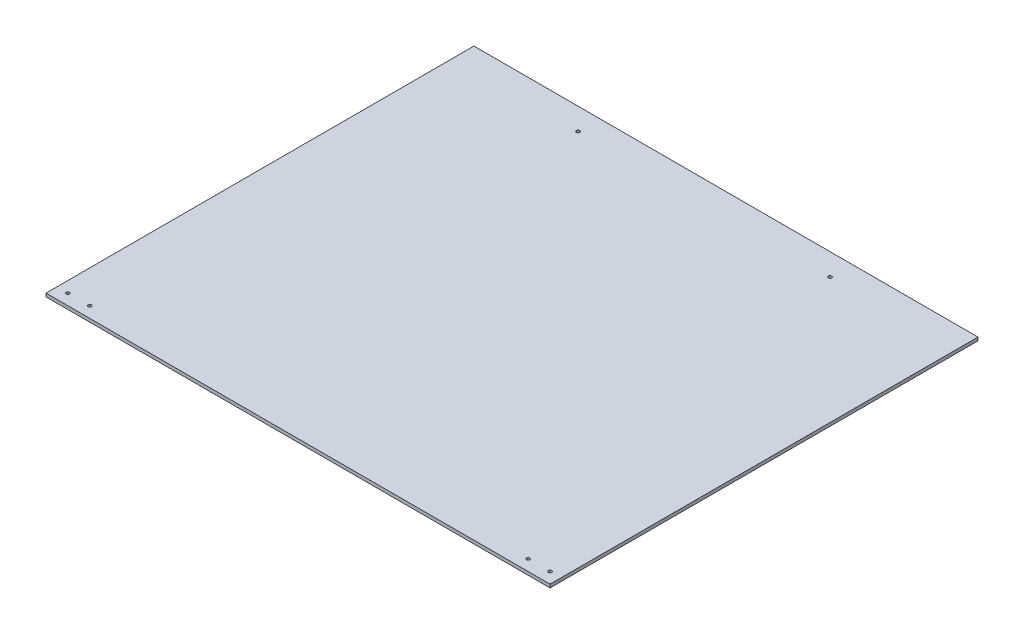
ISO-10303-21;
HEADER;
FILE_DESCRIPTION(('STEP AP214'),'2;1');
FILE_NAME('part.step','',(''),(''),'','','');
FILE_SCHEMA(('AUTOMOTIVE_DESIGN { 1 0 10303 214 1 1 1 1 }'));
ENDSEC;
DATA;
#1=APPLICATION_CONTEXT('core data for automotive mechanical design processes');
#2=APPLICATION_PROTOCOL_DEFINITION('international standard','automotive_design',2000,#1);
#3=PRODUCT_CONTEXT('',#1,'mechanical');
#4=PRODUCT('Part','Part','',(#3));
#5=PRODUCT_RELATED_PRODUCT_CATEGORY('part','',(#4));
#6=PRODUCT_DEFINITION_FORMATION('','',#4);
#7=PRODUCT_DEFINITION_CONTEXT('part definition',#1,'design');
#8=PRODUCT_DEFINITION('design','',#6,#7);
#9=PRODUCT_DEFINITION_SHAPE('','',#8);
#10=(LENGTH_UNIT() NAMED_UNIT(*) SI_UNIT(.MILLI.,.METRE.));
#11=(NAMED_UNIT(*) PLANE_ANGLE_UNIT() SI_UNIT($,.RADIAN.));
#12=(NAMED_UNIT(*) SI_UNIT($,.STERADIAN.) SOLID_ANGLE_UNIT());
#13=UNCERTAINTY_MEASURE_WITH_UNIT(LENGTH_MEASURE(1.E-05),#10,'distance_accuracy_value','');
#14=(GEOMETRIC_REPRESENTATION_CONTEXT(3) GLOBAL_UNCERTAINTY_ASSIGNED_CONTEXT((#13)) GLOBAL_UNIT_ASSIGNED_CONTEXT((#10,
#11,#12)) REPRESENTATION_CONTEXT('',''));
#15=CARTESIAN_POINT('',(0.,0.,0.));
#16=DIRECTION('',(0.,0.,1.));
#17=DIRECTION('',(1.,0.,0.));
#18=AXIS2_PLACEMENT_3D('',#15,#16,#17);
#19=CARTESIAN_POINT('',(0.,3.,0.));
#20=DIRECTION('',(0.,1.,0.));
#21=DIRECTION('',(0.,0.,1.));
#22=AXIS2_PLACEMENT_3D('',#19,#20,#21);
#23=PLANE('',#22);
#24=CARTESIAN_POINT('',(-285.289572375465,3.,238.794136116885));
#25=DIRECTION('',(0.,1.,0.));
#26=DIRECTION('',(0.,0.,-1.));
#27=AXIS2_PLACEMENT_3D('',#24,#25,#26);
#28=CIRCLE('',#27,1.50000000000002);
#29=CARTESIAN_POINT('',(-285.289572375465,3.,237.294136116885));
#30=VERTEX_POINT('',#29);
#31=EDGE_CURVE('E127',#30,#30,#28,.T.);
#32=ORIENTED_EDGE('',*,*,#31,.F.);
#33=EDGE_LOOP('',(#32));
#34=FACE_BOUND('',#33,.T.);
#35=CARTESIAN_POINT('',(-265.289572375465,3.,238.794136116885));
#36=DIRECTION('',(0.,1.,0.));
#37=DIRECTION('',(0.,0.,-1.));
#38=AXIS2_PLACEMENT_3D('',#35,#36,#37);
#39=CIRCLE('',#38,1.50000000000002);
#40=CARTESIAN_POINT('',(-265.289572375465,3.,237.294136116885));
#41=VERTEX_POINT('',#40);
#42=EDGE_CURVE('E261',#41,#41,#39,.T.);
#43=ORIENTED_EDGE('',*,*,#42,.F.);
#44=EDGE_LOOP('',(#43));
#45=FACE_BOUND('',#44,.T.);
#46=CARTESIAN_POINT('',(134.709727779496,3.,238.794136116885));
#47=DIRECTION('',(0.,1.,0.));
#48=DIRECTION('',(0.,0.,1.));
#49=AXIS2_PLACEMENT_3D('',#46,#47,#48);
#50=CIRCLE('',#49,1.5);
#51=CARTESIAN_POINT('',(134.709727779496,3.,240.294136116885));
#52=VERTEX_POINT('',#51);
#53=EDGE_CURVE('E269',#52,#52,#50,.T.);
#54=ORIENTED_EDGE('',*,*,#53,.F.);
#55=EDGE_LOOP('',(#54));
#56=FACE_BOUND('',#55,.T.);
#57=CARTESIAN_POINT('',(154.709727779496,3.,238.794136116885));
#58=DIRECTION('',(0.,1.,0.));
#59=DIRECTION('',(0.,0.,1.));
#60=AXIS2_PLACEMENT_3D('',#57,#58,#59);
#61=CIRCLE('',#60,1.5);
#62=CARTESIAN_POINT('',(154.709727779496,3.,240.294136116885));
#63=VERTEX_POINT('',#62);
#64=EDGE_CURVE('E274',#63,#63,#61,.T.);
#65=ORIENTED_EDGE('',*,*,#64,.F.);
#66=EDGE_LOOP('',(#65));
#67=FACE_BOUND('',#66,.T.);
#68=CARTESIAN_POINT('',(-180.289572375465,3.,-121.737381871304));
#69=DIRECTION('',(0.,1.,0.));
#70=DIRECTION('',(0.,0.,1.));
#71=AXIS2_PLACEMENT_3D('',#68,#69,#70);
#72=CIRCLE('',#71,1.5);
#73=CARTESIAN_POINT('',(-180.289572375465,3.,-120.237381871304));
#74=VERTEX_POINT('',#73);
#75=EDGE_CURVE('E99',#74,#74,#72,.T.);
#76=ORIENTED_EDGE('',*,*,#75,.F.);
#77=EDGE_LOOP('',(#76));
#78=FACE_BOUND('',#77,.T.);
#79=DIRECTION('',(-1.,0.,0.));
#80=VECTOR('',#79,1.);
#81=CARTESIAN_POINT('',(-190.289572375465,3.,-141.737381871304));
#82=LINE('',#81,#80);
#83=CARTESIAN_POINT('',(164.709727779496,3.,-141.737381871304));
#84=VERTEX_POINT('',#83);
#85=CARTESIAN_POINT('',(-295.289572375465,3.,-141.737381871304));
#86=VERTEX_POINT('',#85);
#87=EDGE_CURVE('E50',#84,#86,#82,.T.);
#88=ORIENTED_EDGE('',*,*,#87,.T.);
#89=DIRECTION('',(0.,0.,1.));
#90=VECTOR('',#89,1.);
#91=CARTESIAN_POINT('',(-295.289572375465,3.,-141.737381871304));
#92=LINE('',#91,#90);
#93=CARTESIAN_POINT('',(-295.289572375465,3.,248.794136116885));
#94=VERTEX_POINT('',#93);
#95=EDGE_CURVE('E81',#86,#94,#92,.T.);
#96=ORIENTED_EDGE('',*,*,#95,.T.);
#97=DIRECTION('',(1.,0.,0.));
#98=VECTOR('',#97,1.);
#99=CARTESIAN_POINT('',(-295.289572375465,3.,248.794136116885));
#100=LINE('',#99,#98);
#101=CARTESIAN_POINT('',(164.709727779496,3.,248.794136116885));
#102=VERTEX_POINT('',#101);
#103=EDGE_CURVE('E85',#94,#102,#100,.T.);
#104=ORIENTED_EDGE('',*,*,#103,.T.);
#105=DIRECTION('',(0.,0.,-1.));
#106=VECTOR('',#105,1.);
#107=CARTESIAN_POINT('',(164.709727779496,3.,248.794136116885));
#108=LINE('',#107,#106);
#109=EDGE_CURVE('E92',#102,#84,#108,.T.);
#110=ORIENTED_EDGE('',*,*,#109,.T.);
#111=EDGE_LOOP('',(#88,#96,#104,#110));
#112=FACE_BOUND('',#111,.T.);
#113=CARTESIAN_POINT('',(49.7104276245351,3.,-121.737381871304));
#114=DIRECTION('',(0.,1.,0.));
#115=DIRECTION('',(0.,0.,1.));
#116=AXIS2_PLACEMENT_3D('',#113,#114,#115);
#117=CIRCLE('',#116,1.50000000000002);
#118=CARTESIAN_POINT('',(49.7104276245351,3.,-120.237381871304));
#119=VERTEX_POINT('',#118);
#120=EDGE_CURVE('E121',#119,#119,#117,.T.);
#121=ORIENTED_EDGE('',*,*,#120,.F.);
#122=EDGE_LOOP('',(#121));
#123=FACE_BOUND('',#122,.T.);
#124=ADVANCED_FACE('F33',(#34,#45,#56,#67,#78,#112,#123),#23,.T.);
#125=CARTESIAN_POINT('',(0.,0.,0.));
#126=DIRECTION('',(0.,1.,0.));
#127=DIRECTION('',(0.,0.,1.));
#128=AXIS2_PLACEMENT_3D('',#125,#126,#127);
#129=PLANE('',#128);
#130=CARTESIAN_POINT('',(-285.289572375465,0.,238.794136116885));
#131=DIRECTION('',(0.,1.,0.));
#132=DIRECTION('',(0.,0.,-1.));
#133=AXIS2_PLACEMENT_3D('',#130,#131,#132);
#134=CIRCLE('',#133,1.50000000000002);
#135=CARTESIAN_POINT('',(-285.289572375465,0.,237.294136116885));
#136=VERTEX_POINT('',#135);
#137=EDGE_CURVE('E122',#136,#136,#134,.T.);
#138=ORIENTED_EDGE('',*,*,#137,.T.);
#139=EDGE_LOOP('',(#138));
#140=FACE_BOUND('',#139,.T.);
#141=CARTESIAN_POINT('',(-265.289572375465,0.,238.794136116885));
#142=DIRECTION('',(0.,1.,0.));
#143=DIRECTION('',(0.,0.,-1.));
#144=AXIS2_PLACEMENT_3D('',#141,#142,#143);
#145=CIRCLE('',#144,1.50000000000002);
#146=CARTESIAN_POINT('',(-265.289572375465,0.,237.294136116885));
#147=VERTEX_POINT('',#146);
#148=EDGE_CURVE('E258',#147,#147,#145,.T.);
#149=ORIENTED_EDGE('',*,*,#148,.T.);
#150=EDGE_LOOP('',(#149));
#151=FACE_BOUND('',#150,.T.);
#152=CARTESIAN_POINT('',(134.709727779496,0.,238.794136116885));
#153=DIRECTION('',(0.,1.,0.));
#154=DIRECTION('',(0.,0.,1.));
#155=AXIS2_PLACEMENT_3D('',#152,#153,#154);
#156=CIRCLE('',#155,1.5);
#157=CARTESIAN_POINT('',(134.709727779496,0.,240.294136116885));
#158=VERTEX_POINT('',#157);
#159=EDGE_CURVE('E266',#158,#158,#156,.T.);
#160=ORIENTED_EDGE('',*,*,#159,.T.);
#161=EDGE_LOOP('',(#160));
#162=FACE_BOUND('',#161,.T.);
#163=CARTESIAN_POINT('',(154.709727779496,0.,238.794136116885));
#164=DIRECTION('',(0.,1.,0.));
#165=DIRECTION('',(0.,0.,1.));
#166=AXIS2_PLACEMENT_3D('',#163,#164,#165);
#167=CIRCLE('',#166,1.5);
#168=CARTESIAN_POINT('',(154.709727779496,0.,240.294136116885));
#169=VERTEX_POINT('',#168);
#170=EDGE_CURVE('E272',#169,#169,#167,.T.);
#171=ORIENTED_EDGE('',*,*,#170,.T.);
#172=EDGE_LOOP('',(#171));
#173=FACE_BOUND('',#172,.T.);
#174=DIRECTION('',(0.,0.,1.));
#175=VECTOR('',#174,1.);
#176=CARTESIAN_POINT('',(-295.289572375465,0.,-141.737381871304));
#177=LINE('',#176,#175);
#178=CARTESIAN_POINT('',(-295.289572375465,0.,-141.737381871304));
#179=VERTEX_POINT('',#178);
#180=CARTESIAN_POINT('',(-295.289572375465,0.,248.794136116885));
#181=VERTEX_POINT('',#180);
#182=EDGE_CURVE('E88',#179,#181,#177,.T.);
#183=ORIENTED_EDGE('',*,*,#182,.F.);
#184=DIRECTION('',(-1.,0.,0.));
#185=VECTOR('',#184,1.);
#186=CARTESIAN_POINT('',(-170.289572375465,0.,-141.737381871304));
#187=LINE('',#186,#185);
#188=CARTESIAN_POINT('',(164.709727779496,0.,-141.737381871304));
#189=VERTEX_POINT('',#188);
#190=EDGE_CURVE('E75',#189,#179,#187,.T.);
#191=ORIENTED_EDGE('',*,*,#190,.F.);
#192=DIRECTION('',(0.,0.,-1.));
#193=VECTOR('',#192,1.);
#194=CARTESIAN_POINT('',(164.709727779496,0.,248.794136116885));
#195=LINE('',#194,#193);
#196=CARTESIAN_POINT('',(164.709727779496,0.,248.794136116885));
#197=VERTEX_POINT('',#196);
#198=EDGE_CURVE('E101',#197,#189,#195,.T.);
#199=ORIENTED_EDGE('',*,*,#198,.F.);
#200=DIRECTION('',(1.,0.,0.));
#201=VECTOR('',#200,1.);
#202=CARTESIAN_POINT('',(-295.289572375465,0.,248.794136116885));
#203=LINE('',#202,#201);
#204=EDGE_CURVE('E68',#181,#197,#203,.T.);
#205=ORIENTED_EDGE('',*,*,#204,.F.);
#206=EDGE_LOOP('',(#183,#191,#199,#205));
#207=FACE_BOUND('',#206,.T.);
#208=CARTESIAN_POINT('',(-180.289572375465,0.,-121.737381871304));
#209=DIRECTION('',(0.,1.,0.));
#210=DIRECTION('',(0.,0.,1.));
#211=AXIS2_PLACEMENT_3D('',#208,#209,#210);
#212=CIRCLE('',#211,1.5);
#213=CARTESIAN_POINT('',(-180.289572375465,0.,-120.237381871304));
#214=VERTEX_POINT('',#213);
#215=EDGE_CURVE('E116',#214,#214,#212,.T.);
#216=ORIENTED_EDGE('',*,*,#215,.T.);
#217=EDGE_LOOP('',(#216));
#218=FACE_BOUND('',#217,.T.);
#219=CARTESIAN_POINT('',(49.7104276245351,0.,-121.737381871304));
#220=DIRECTION('',(0.,1.,0.));
#221=DIRECTION('',(0.,0.,1.));
#222=AXIS2_PLACEMENT_3D('',#219,#220,#221);
#223=CIRCLE('',#222,1.50000000000002);
#224=CARTESIAN_POINT('',(49.7104276245351,0.,-120.237381871304));
#225=VERTEX_POINT('',#224);
#226=EDGE_CURVE('E119',#225,#225,#223,.T.);
#227=ORIENTED_EDGE('',*,*,#226,.T.);
#228=EDGE_LOOP('',(#227));
#229=FACE_BOUND('',#228,.T.);
#230=ADVANCED_FACE('F108',(#140,#151,#162,#173,#207,#218,#229),#129,.F.);
#231=CARTESIAN_POINT('',(-295.289572375465,3.,-141.737381871304));
#232=DIRECTION('',(1.,0.,0.));
#233=DIRECTION('',(0.,0.,-1.));
#234=AXIS2_PLACEMENT_3D('',#231,#232,#233);
#235=PLANE('',#234);
#236=ORIENTED_EDGE('',*,*,#182,.T.);
#237=DIRECTION('',(0.,-1.,0.));
#238=VECTOR('',#237,1.);
#239=CARTESIAN_POINT('',(-295.289572375465,3.,248.794136116885));
#240=LINE('',#239,#238);
#241=EDGE_CURVE('E42',#94,#181,#240,.T.);
#242=ORIENTED_EDGE('',*,*,#241,.F.);
#243=ORIENTED_EDGE('',*,*,#95,.F.);
#244=DIRECTION('',(0.,-1.,0.));
#245=VECTOR('',#244,1.);
#246=CARTESIAN_POINT('',(-295.289572375465,3.,-141.737381871304));
#247=LINE('',#246,#245);
#248=EDGE_CURVE('E11',#86,#179,#247,.T.);
#249=ORIENTED_EDGE('',*,*,#248,.T.);
#250=EDGE_LOOP('',(#236,#242,#243,#249));
#251=FACE_BOUND('',#250,.T.);
#252=ADVANCED_FACE('F35',(#251),#235,.F.);
#253=CARTESIAN_POINT('',(-295.289572375465,3.,248.794136116885));
#254=DIRECTION('',(0.,0.,-1.));
#255=DIRECTION('',(-1.,0.,0.));
#256=AXIS2_PLACEMENT_3D('',#253,#254,#255);
#257=PLANE('',#256);
#258=ORIENTED_EDGE('',*,*,#204,.T.);
#259=DIRECTION('',(0.,-1.,0.));
#260=VECTOR('',#259,1.);
#261=CARTESIAN_POINT('',(164.709727779496,3.,248.794136116885));
#262=LINE('',#261,#260);
#263=EDGE_CURVE('E89',#102,#197,#262,.T.);
#264=ORIENTED_EDGE('',*,*,#263,.F.);
#265=ORIENTED_EDGE('',*,*,#103,.F.);
#266=ORIENTED_EDGE('',*,*,#241,.T.);
#267=EDGE_LOOP('',(#258,#264,#265,#266));
#268=FACE_BOUND('',#267,.T.);
#269=ADVANCED_FACE('F90',(#268),#257,.F.);
#270=CARTESIAN_POINT('',(164.709727779496,3.,248.794136116885));
#271=DIRECTION('',(-1.,0.,0.));
#272=DIRECTION('',(0.,0.,1.));
#273=AXIS2_PLACEMENT_3D('',#270,#271,#272);
#274=PLANE('',#273);
#275=ORIENTED_EDGE('',*,*,#198,.T.);
#276=DIRECTION('',(0.,-1.,0.));
#277=VECTOR('',#276,1.);
#278=CARTESIAN_POINT('',(164.709727779496,3.,-141.737381871304));
#279=LINE('',#278,#277);
#280=EDGE_CURVE('E94',#84,#189,#279,.T.);
#281=ORIENTED_EDGE('',*,*,#280,.F.);
#282=ORIENTED_EDGE('',*,*,#109,.F.);
#283=ORIENTED_EDGE('',*,*,#263,.T.);
#284=EDGE_LOOP('',(#275,#281,#282,#283));
#285=FACE_BOUND('',#284,.T.);
#286=ADVANCED_FACE('F106',(#285),#274,.F.);
#287=CARTESIAN_POINT('',(-170.289572375465,3.,-141.737381871304));
#288=DIRECTION('',(0.,0.,1.));
#289=DIRECTION('',(1.,0.,0.));
#290=AXIS2_PLACEMENT_3D('',#287,#288,#289);
#291=PLANE('',#290);
#292=ORIENTED_EDGE('',*,*,#190,.T.);
#293=ORIENTED_EDGE('',*,*,#248,.F.);
#294=ORIENTED_EDGE('',*,*,#87,.F.);
#295=ORIENTED_EDGE('',*,*,#280,.T.);
#296=EDGE_LOOP('',(#292,#293,#294,#295));
#297=FACE_BOUND('',#296,.T.);
#298=ADVANCED_FACE('F148',(#297),#291,.F.);
#299=CARTESIAN_POINT('',(-180.289572375465,3.,-121.737381871304));
#300=DIRECTION('',(0.,-1.,0.));
#301=DIRECTION('',(0.,0.,-1.));
#302=AXIS2_PLACEMENT_3D('',#299,#300,#301);
#303=CYLINDRICAL_SURFACE('',#302,1.5);
#304=ORIENTED_EDGE('',*,*,#75,.T.);
#305=EDGE_LOOP('',(#304));
#306=FACE_BOUND('',#305,.T.);
#307=ORIENTED_EDGE('',*,*,#215,.F.);
#308=EDGE_LOOP('',(#307));
#309=FACE_BOUND('',#308,.T.);
#310=ADVANCED_FACE('F135',(#306,#309),#303,.F.);
#311=CARTESIAN_POINT('',(49.7104276245351,3.,-121.737381871304));
#312=DIRECTION('',(0.,-1.,0.));
#313=DIRECTION('',(0.,0.,-1.));
#314=AXIS2_PLACEMENT_3D('',#311,#312,#313);
#315=CYLINDRICAL_SURFACE('',#314,1.50000000000002);
#316=ORIENTED_EDGE('',*,*,#120,.T.);
#317=EDGE_LOOP('',(#316));
#318=FACE_BOUND('',#317,.T.);
#319=ORIENTED_EDGE('',*,*,#226,.F.);
#320=EDGE_LOOP('',(#319));
#321=FACE_BOUND('',#320,.T.);
#322=ADVANCED_FACE('F176',(#318,#321),#315,.F.);
#323=CARTESIAN_POINT('',(154.709727779496,0.,238.794136116885));
#324=DIRECTION('',(0.,1.,0.));
#325=DIRECTION('',(0.,0.,1.));
#326=AXIS2_PLACEMENT_3D('',#323,#324,#325);
#327=CYLINDRICAL_SURFACE('',#326,1.5);
#328=ORIENTED_EDGE('',*,*,#170,.F.);
#329=EDGE_LOOP('',(#328));
#330=FACE_BOUND('',#329,.T.);
#331=ORIENTED_EDGE('',*,*,#64,.T.);
#332=EDGE_LOOP('',(#331));
#333=FACE_BOUND('',#332,.T.);
#334=ADVANCED_FACE('F170',(#330,#333),#327,.F.);
#335=CARTESIAN_POINT('',(134.709727779496,0.,238.794136116885));
#336=DIRECTION('',(0.,1.,0.));
#337=DIRECTION('',(0.,0.,1.));
#338=AXIS2_PLACEMENT_3D('',#335,#336,#337);
#339=CYLINDRICAL_SURFACE('',#338,1.5);
#340=ORIENTED_EDGE('',*,*,#159,.F.);
#341=EDGE_LOOP('',(#340));
#342=FACE_BOUND('',#341,.T.);
#343=ORIENTED_EDGE('',*,*,#53,.T.);
#344=EDGE_LOOP('',(#343));
#345=FACE_BOUND('',#344,.T.);
#346=ADVANCED_FACE('F175',(#342,#345),#339,.F.);
#347=CARTESIAN_POINT('',(-265.289572375465,0.,238.794136116885));
#348=DIRECTION('',(0.,1.,0.));
#349=DIRECTION('',(0.,0.,1.));
#350=AXIS2_PLACEMENT_3D('',#347,#348,#349);
#351=CYLINDRICAL_SURFACE('',#350,1.50000000000002);
#352=ORIENTED_EDGE('',*,*,#148,.F.);
#353=EDGE_LOOP('',(#352));
#354=FACE_BOUND('',#353,.T.);
#355=ORIENTED_EDGE('',*,*,#42,.T.);
#356=EDGE_LOOP('',(#355));
#357=FACE_BOUND('',#356,.T.);
#358=ADVANCED_FACE('F188',(#354,#357),#351,.F.);
#359=CARTESIAN_POINT('',(-285.289572375465,0.,238.794136116885));
#360=DIRECTION('',(0.,1.,0.));
#361=DIRECTION('',(0.,0.,1.));
#362=AXIS2_PLACEMENT_3D('',#359,#360,#361);
#363=CYLINDRICAL_SURFACE('',#362,1.50000000000002);
#364=ORIENTED_EDGE('',*,*,#137,.F.);
#365=EDGE_LOOP('',(#364));
#366=FACE_BOUND('',#365,.T.);
#367=ORIENTED_EDGE('',*,*,#31,.T.);
#368=EDGE_LOOP('',(#367));
#369=FACE_BOUND('',#368,.T.);
#370=ADVANCED_FACE('F198',(#366,#369),#363,.F.);
#371=CLOSED_SHELL('',(#124,#230,#252,#269,#286,#298,#310,#322,#334,#346,#358,#370));
#372=MANIFOLD_SOLID_BREP('B2',#371);
#373=ADVANCED_BREP_SHAPE_REPRESENTATION('',(#18,#372),#14);
#374=SHAPE_DEFINITION_REPRESENTATION(#9,#373);
ENDSEC;
END-ISO-10303-21;
